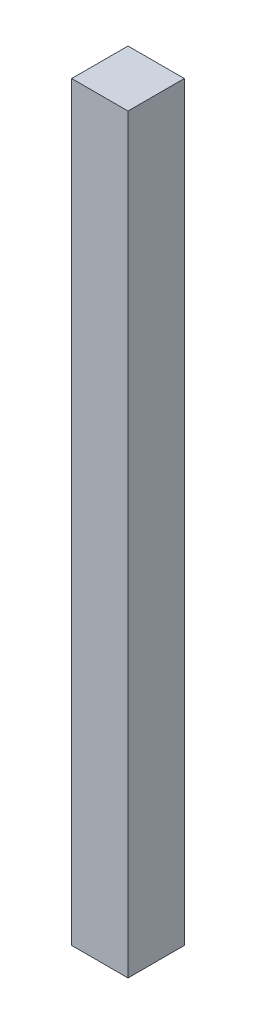
ISO-10303-21;
HEADER;
FILE_DESCRIPTION(('STEP AP214'),'2;1');
FILE_NAME('part.step','',(''),(''),'','','');
FILE_SCHEMA(('AUTOMOTIVE_DESIGN { 1 0 10303 214 1 1 1 1 }'));
ENDSEC;
DATA;
#1=APPLICATION_CONTEXT('core data for automotive mechanical design processes');
#2=APPLICATION_PROTOCOL_DEFINITION('international standard','automotive_design',2000,#1);
#3=PRODUCT_CONTEXT('',#1,'mechanical');
#4=PRODUCT('Part','Part','',(#3));
#5=PRODUCT_RELATED_PRODUCT_CATEGORY('part','',(#4));
#6=PRODUCT_DEFINITION_FORMATION('','',#4);
#7=PRODUCT_DEFINITION_CONTEXT('part definition',#1,'design');
#8=PRODUCT_DEFINITION('design','',#6,#7);
#9=PRODUCT_DEFINITION_SHAPE('','',#8);
#10=(LENGTH_UNIT() NAMED_UNIT(*) SI_UNIT(.MILLI.,.METRE.));
#11=(NAMED_UNIT(*) PLANE_ANGLE_UNIT() SI_UNIT($,.RADIAN.));
#12=(NAMED_UNIT(*) SI_UNIT($,.STERADIAN.) SOLID_ANGLE_UNIT());
#13=UNCERTAINTY_MEASURE_WITH_UNIT(LENGTH_MEASURE(1.E-05),#10,'distance_accuracy_value','');
#14=(GEOMETRIC_REPRESENTATION_CONTEXT(3) GLOBAL_UNCERTAINTY_ASSIGNED_CONTEXT((#13)) GLOBAL_UNIT_ASSIGNED_CONTEXT((#10,
#11,#12)) REPRESENTATION_CONTEXT('',''));
#15=CARTESIAN_POINT('',(0.,0.,0.));
#16=DIRECTION('',(0.,0.,1.));
#17=DIRECTION('',(1.,0.,0.));
#18=AXIS2_PLACEMENT_3D('',#15,#16,#17);
#19=CARTESIAN_POINT('',(-7.5,200.,-7.5));
#20=DIRECTION('',(1.,0.,0.));
#21=DIRECTION('',(0.,0.,-1.));
#22=AXIS2_PLACEMENT_3D('',#19,#20,#21);
#23=PLANE('',#22);
#24=DIRECTION('',(0.,0.,1.));
#25=VECTOR('',#24,1.);
#26=CARTESIAN_POINT('',(-7.5,0.,-7.5));
#27=LINE('',#26,#25);
#28=CARTESIAN_POINT('',(-7.5,0.,-7.5));
#29=VERTEX_POINT('',#28);
#30=CARTESIAN_POINT('',(-7.5,0.,7.5));
#31=VERTEX_POINT('',#30);
#32=EDGE_CURVE('E96',#29,#31,#27,.T.);
#33=ORIENTED_EDGE('',*,*,#32,.T.);
#34=DIRECTION('',(0.,-1.,0.));
#35=VECTOR('',#34,1.);
#36=CARTESIAN_POINT('',(-7.5,200.,7.5));
#37=LINE('',#36,#35);
#38=CARTESIAN_POINT('',(-7.5,200.,7.5));
#39=VERTEX_POINT('',#38);
#40=EDGE_CURVE('E11',#39,#31,#37,.T.);
#41=ORIENTED_EDGE('',*,*,#40,.F.);
#42=DIRECTION('',(0.,0.,1.));
#43=VECTOR('',#42,1.);
#44=CARTESIAN_POINT('',(-7.5,200.,-7.5));
#45=LINE('',#44,#43);
#46=CARTESIAN_POINT('',(-7.5,200.,-7.5));
#47=VERTEX_POINT('',#46);
#48=EDGE_CURVE('E84',#47,#39,#45,.T.);
#49=ORIENTED_EDGE('',*,*,#48,.F.);
#50=DIRECTION('',(0.,-1.,0.));
#51=VECTOR('',#50,1.);
#52=CARTESIAN_POINT('',(-7.5,200.,-7.5));
#53=LINE('',#52,#51);
#54=EDGE_CURVE('E92',#47,#29,#53,.T.);
#55=ORIENTED_EDGE('',*,*,#54,.T.);
#56=EDGE_LOOP('',(#33,#41,#49,#55));
#57=FACE_BOUND('',#56,.T.);
#58=ADVANCED_FACE('F33',(#57),#23,.F.);
#59=CARTESIAN_POINT('',(7.5,200.,7.5));
#60=DIRECTION('',(0.,0.,-1.));
#61=DIRECTION('',(-1.,0.,0.));
#62=AXIS2_PLACEMENT_3D('',#59,#60,#61);
#63=PLANE('',#62);
#64=DIRECTION('',(1.,0.,0.));
#65=VECTOR('',#64,1.);
#66=CARTESIAN_POINT('',(7.5,0.,7.5));
#67=LINE('',#66,#65);
#68=CARTESIAN_POINT('',(7.5,0.,7.5));
#69=VERTEX_POINT('',#68);
#70=EDGE_CURVE('E88',#31,#69,#67,.T.);
#71=ORIENTED_EDGE('',*,*,#70,.T.);
#72=DIRECTION('',(0.,-1.,0.));
#73=VECTOR('',#72,1.);
#74=CARTESIAN_POINT('',(7.5,200.,7.5));
#75=LINE('',#74,#73);
#76=CARTESIAN_POINT('',(7.5,200.,7.5));
#77=VERTEX_POINT('',#76);
#78=EDGE_CURVE('E41',#77,#69,#75,.T.);
#79=ORIENTED_EDGE('',*,*,#78,.F.);
#80=DIRECTION('',(1.,0.,0.));
#81=VECTOR('',#80,1.);
#82=CARTESIAN_POINT('',(7.5,200.,7.5));
#83=LINE('',#82,#81);
#84=EDGE_CURVE('E79',#39,#77,#83,.T.);
#85=ORIENTED_EDGE('',*,*,#84,.F.);
#86=ORIENTED_EDGE('',*,*,#40,.T.);
#87=EDGE_LOOP('',(#71,#79,#85,#86));
#88=FACE_BOUND('',#87,.T.);
#89=ADVANCED_FACE('F87',(#88),#63,.F.);
#90=CARTESIAN_POINT('',(7.5,200.,-7.5));
#91=DIRECTION('',(-1.,0.,0.));
#92=DIRECTION('',(0.,0.,1.));
#93=AXIS2_PLACEMENT_3D('',#90,#91,#92);
#94=PLANE('',#93);
#95=DIRECTION('',(0.,0.,-1.));
#96=VECTOR('',#95,1.);
#97=CARTESIAN_POINT('',(7.5,0.,-7.5));
#98=LINE('',#97,#96);
#99=CARTESIAN_POINT('',(7.5,0.,-7.5));
#100=VERTEX_POINT('',#99);
#101=EDGE_CURVE('E66',#69,#100,#98,.T.);
#102=ORIENTED_EDGE('',*,*,#101,.T.);
#103=DIRECTION('',(0.,-1.,0.));
#104=VECTOR('',#103,1.);
#105=CARTESIAN_POINT('',(7.5,200.,-7.5));
#106=LINE('',#105,#104);
#107=CARTESIAN_POINT('',(7.5,200.,-7.5));
#108=VERTEX_POINT('',#107);
#109=EDGE_CURVE('E89',#108,#100,#106,.T.);
#110=ORIENTED_EDGE('',*,*,#109,.F.);
#111=DIRECTION('',(0.,0.,-1.));
#112=VECTOR('',#111,1.);
#113=CARTESIAN_POINT('',(7.5,200.,-7.5));
#114=LINE('',#113,#112);
#115=EDGE_CURVE('E82',#77,#108,#114,.T.);
#116=ORIENTED_EDGE('',*,*,#115,.F.);
#117=ORIENTED_EDGE('',*,*,#78,.T.);
#118=EDGE_LOOP('',(#102,#110,#116,#117));
#119=FACE_BOUND('',#118,.T.);
#120=ADVANCED_FACE('F90',(#119),#94,.F.);
#121=CARTESIAN_POINT('',(7.5,200.,-7.5));
#122=DIRECTION('',(0.,0.,1.));
#123=DIRECTION('',(1.,0.,0.));
#124=AXIS2_PLACEMENT_3D('',#121,#122,#123);
#125=PLANE('',#124);
#126=DIRECTION('',(-1.,0.,0.));
#127=VECTOR('',#126,1.);
#128=CARTESIAN_POINT('',(7.5,0.,-7.5));
#129=LINE('',#128,#127);
#130=EDGE_CURVE('E72',#100,#29,#129,.T.);
#131=ORIENTED_EDGE('',*,*,#130,.T.);
#132=ORIENTED_EDGE('',*,*,#54,.F.);
#133=DIRECTION('',(-1.,0.,0.));
#134=VECTOR('',#133,1.);
#135=CARTESIAN_POINT('',(7.5,200.,-7.5));
#136=LINE('',#135,#134);
#137=EDGE_CURVE('E49',#108,#47,#136,.T.);
#138=ORIENTED_EDGE('',*,*,#137,.F.);
#139=ORIENTED_EDGE('',*,*,#109,.T.);
#140=EDGE_LOOP('',(#131,#132,#138,#139));
#141=FACE_BOUND('',#140,.T.);
#142=ADVANCED_FACE('F103',(#141),#125,.F.);
#143=CARTESIAN_POINT('',(0.,200.,0.));
#144=DIRECTION('',(0.,-1.,0.));
#145=DIRECTION('',(0.,0.,-1.));
#146=AXIS2_PLACEMENT_3D('',#143,#144,#145);
#147=PLANE('',#146);
#148=ORIENTED_EDGE('',*,*,#48,.T.);
#149=ORIENTED_EDGE('',*,*,#84,.T.);
#150=ORIENTED_EDGE('',*,*,#115,.T.);
#151=ORIENTED_EDGE('',*,*,#137,.T.);
#152=EDGE_LOOP('',(#148,#149,#150,#151));
#153=FACE_BOUND('',#152,.T.);
#154=ADVANCED_FACE('F80',(#153),#147,.F.);
#155=CARTESIAN_POINT('',(0.,0.,0.));
#156=DIRECTION('',(0.,-1.,0.));
#157=DIRECTION('',(0.,0.,-1.));
#158=AXIS2_PLACEMENT_3D('',#155,#156,#157);
#159=PLANE('',#158);
#160=ORIENTED_EDGE('',*,*,#32,.F.);
#161=ORIENTED_EDGE('',*,*,#130,.F.);
#162=ORIENTED_EDGE('',*,*,#101,.F.);
#163=ORIENTED_EDGE('',*,*,#70,.F.);
#164=EDGE_LOOP('',(#160,#161,#162,#163));
#165=FACE_BOUND('',#164,.T.);
#166=ADVANCED_FACE('F106',(#165),#159,.T.);
#167=CLOSED_SHELL('',(#58,#89,#120,#142,#154,#166));
#168=MANIFOLD_SOLID_BREP('B2',#167);
#169=ADVANCED_BREP_SHAPE_REPRESENTATION('',(#18,#168),#14);
#170=SHAPE_DEFINITION_REPRESENTATION(#9,#169);
ENDSEC;
END-ISO-10303-21;
